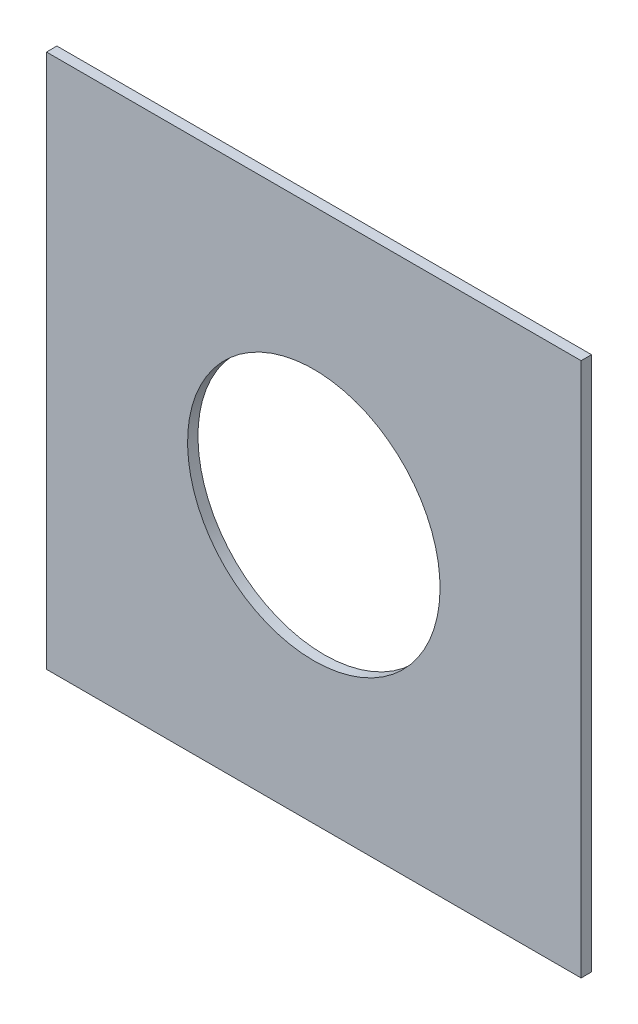
ISO-10303-21;
HEADER;
FILE_DESCRIPTION(('STEP AP214'),'2;1');
FILE_NAME('part.step','',(''),(''),'','','');
FILE_SCHEMA(('AUTOMOTIVE_DESIGN { 1 0 10303 214 1 1 1 1 }'));
ENDSEC;
DATA;
#1=APPLICATION_CONTEXT('core data for automotive mechanical design processes');
#2=APPLICATION_PROTOCOL_DEFINITION('international standard','automotive_design',2000,#1);
#3=PRODUCT_CONTEXT('',#1,'mechanical');
#4=PRODUCT('Part','Part','',(#3));
#5=PRODUCT_RELATED_PRODUCT_CATEGORY('part','',(#4));
#6=PRODUCT_DEFINITION_FORMATION('','',#4);
#7=PRODUCT_DEFINITION_CONTEXT('part definition',#1,'design');
#8=PRODUCT_DEFINITION('design','',#6,#7);
#9=PRODUCT_DEFINITION_SHAPE('','',#8);
#10=(LENGTH_UNIT() NAMED_UNIT(*) SI_UNIT(.MILLI.,.METRE.));
#11=(NAMED_UNIT(*) PLANE_ANGLE_UNIT() SI_UNIT($,.RADIAN.));
#12=(NAMED_UNIT(*) SI_UNIT($,.STERADIAN.) SOLID_ANGLE_UNIT());
#13=UNCERTAINTY_MEASURE_WITH_UNIT(LENGTH_MEASURE(1.E-05),#10,'distance_accuracy_value','');
#14=(GEOMETRIC_REPRESENTATION_CONTEXT(3) GLOBAL_UNCERTAINTY_ASSIGNED_CONTEXT((#13)) GLOBAL_UNIT_ASSIGNED_CONTEXT((#10,
#11,#12)) REPRESENTATION_CONTEXT('',''));
#15=CARTESIAN_POINT('',(0.,0.,0.));
#16=DIRECTION('',(0.,0.,1.));
#17=DIRECTION('',(1.,0.,0.));
#18=AXIS2_PLACEMENT_3D('',#15,#16,#17);
#19=CARTESIAN_POINT('',(118.105,-153.249,-0.045));
#20=DIRECTION('',(0.,0.,-1.));
#21=DIRECTION('',(0.,-1.,0.));
#22=AXIS2_PLACEMENT_3D('',#19,#20,#21);
#23=CYLINDRICAL_SURFACE('',#22,0.425);
#24=CARTESIAN_POINT('',(118.105,-153.249,-0.035));
#25=DIRECTION('',(0.,0.,-1.));
#26=DIRECTION('',(0.,-1.,0.));
#27=AXIS2_PLACEMENT_3D('',#24,#25,#26);
#28=CIRCLE('',#27,0.425);
#29=CARTESIAN_POINT('',(118.105,-153.674,-0.035));
#30=VERTEX_POINT('',#29);
#31=EDGE_CURVE('E114',#30,#30,#28,.T.);
#32=ORIENTED_EDGE('',*,*,#31,.T.);
#33=DIRECTION('',(0.,0.,1.));
#34=VECTOR('',#33,1.);
#35=CARTESIAN_POINT('',(118.105,-153.674,-0.045));
#36=LINE('',#35,#34);
#37=CARTESIAN_POINT('',(118.105,-153.674,0.));
#38=VERTEX_POINT('',#37);
#39=EDGE_CURVE('E11',#30,#38,#36,.T.);
#40=ORIENTED_EDGE('',*,*,#39,.T.);
#41=CARTESIAN_POINT('',(118.105,-153.249,0.));
#42=DIRECTION('',(0.,0.,-1.));
#43=DIRECTION('',(0.,-1.,0.));
#44=AXIS2_PLACEMENT_3D('',#41,#42,#43);
#45=CIRCLE('',#44,0.425);
#46=EDGE_CURVE('E20',#38,#38,#45,.T.);
#47=ORIENTED_EDGE('',*,*,#46,.F.);
#48=ORIENTED_EDGE('',*,*,#39,.F.);
#49=EDGE_LOOP('',(#32,#40,#47,#48));
#50=FACE_BOUND('',#49,.T.);
#51=ADVANCED_FACE('F17',(#50),#23,.F.);
#52=CARTESIAN_POINT('',(117.205,-152.349,-0.035));
#53=DIRECTION('',(0.,1.,0.));
#54=DIRECTION('',(1.,0.,0.));
#55=AXIS2_PLACEMENT_3D('',#52,#53,#54);
#56=PLANE('',#55);
#57=DIRECTION('',(0.,0.,1.));
#58=VECTOR('',#57,1.);
#59=CARTESIAN_POINT('',(117.205,-152.349,-0.035));
#60=LINE('',#59,#58);
#61=CARTESIAN_POINT('',(117.205,-152.349,-0.035));
#62=VERTEX_POINT('',#61);
#63=CARTESIAN_POINT('',(117.205,-152.349,0.));
#64=VERTEX_POINT('',#63);
#65=EDGE_CURVE('E117',#62,#64,#60,.T.);
#66=ORIENTED_EDGE('',*,*,#65,.T.);
#67=DIRECTION('',(1.,0.,0.));
#68=VECTOR('',#67,1.);
#69=CARTESIAN_POINT('',(117.205,-152.349,0.));
#70=LINE('',#69,#68);
#71=CARTESIAN_POINT('',(119.005,-152.349,0.));
#72=VERTEX_POINT('',#71);
#73=EDGE_CURVE('E111',#64,#72,#70,.T.);
#74=ORIENTED_EDGE('',*,*,#73,.T.);
#75=DIRECTION('',(0.,0.,1.));
#76=VECTOR('',#75,1.);
#77=CARTESIAN_POINT('',(119.005,-152.349,-0.035));
#78=LINE('',#77,#76);
#79=CARTESIAN_POINT('',(119.005,-152.349,-0.035));
#80=VERTEX_POINT('',#79);
#81=EDGE_CURVE('E97',#80,#72,#78,.T.);
#82=ORIENTED_EDGE('',*,*,#81,.F.);
#83=DIRECTION('',(1.,0.,0.));
#84=VECTOR('',#83,1.);
#85=CARTESIAN_POINT('',(117.205,-152.349,-0.035));
#86=LINE('',#85,#84);
#87=EDGE_CURVE('E80',#62,#80,#86,.T.);
#88=ORIENTED_EDGE('',*,*,#87,.F.);
#89=EDGE_LOOP('',(#66,#74,#82,#88));
#90=FACE_BOUND('',#89,.T.);
#91=ADVANCED_FACE('F149',(#90),#56,.T.);
#92=CARTESIAN_POINT('',(0.,0.,0.));
#93=DIRECTION('',(0.,0.,1.));
#94=DIRECTION('',(1.,0.,0.));
#95=AXIS2_PLACEMENT_3D('',#92,#93,#94);
#96=PLANE('',#95);
#97=ORIENTED_EDGE('',*,*,#46,.T.);
#98=EDGE_LOOP('',(#97));
#99=FACE_BOUND('',#98,.T.);
#100=DIRECTION('',(-1.,0.,0.));
#101=VECTOR('',#100,1.);
#102=CARTESIAN_POINT('',(119.005,-154.149,0.));
#103=LINE('',#102,#101);
#104=CARTESIAN_POINT('',(119.005,-154.149,0.));
#105=VERTEX_POINT('',#104);
#106=CARTESIAN_POINT('',(117.205,-154.149,0.));
#107=VERTEX_POINT('',#106);
#108=EDGE_CURVE('E103',#105,#107,#103,.T.);
#109=ORIENTED_EDGE('',*,*,#108,.F.);
#110=DIRECTION('',(0.,-1.,0.));
#111=VECTOR('',#110,1.);
#112=CARTESIAN_POINT('',(119.005,-152.349,0.));
#113=LINE('',#112,#111);
#114=EDGE_CURVE('E87',#72,#105,#113,.T.);
#115=ORIENTED_EDGE('',*,*,#114,.F.);
#116=ORIENTED_EDGE('',*,*,#73,.F.);
#117=DIRECTION('',(0.,1.,0.));
#118=VECTOR('',#117,1.);
#119=CARTESIAN_POINT('',(117.205,-154.149,0.));
#120=LINE('',#119,#118);
#121=EDGE_CURVE('E86',#107,#64,#120,.T.);
#122=ORIENTED_EDGE('',*,*,#121,.F.);
#123=EDGE_LOOP('',(#109,#115,#116,#122));
#124=FACE_BOUND('',#123,.T.);
#125=ADVANCED_FACE('F139',(#99,#124),#96,.T.);
#126=CARTESIAN_POINT('',(0.,0.,-0.035));
#127=DIRECTION('',(0.,0.,1.));
#128=DIRECTION('',(1.,0.,0.));
#129=AXIS2_PLACEMENT_3D('',#126,#127,#128);
#130=PLANE('',#129);
#131=ORIENTED_EDGE('',*,*,#31,.F.);
#132=EDGE_LOOP('',(#131));
#133=FACE_BOUND('',#132,.T.);
#134=DIRECTION('',(0.,1.,0.));
#135=VECTOR('',#134,1.);
#136=CARTESIAN_POINT('',(117.205,-154.149,-0.035));
#137=LINE('',#136,#135);
#138=CARTESIAN_POINT('',(117.205,-154.149,-0.035));
#139=VERTEX_POINT('',#138);
#140=EDGE_CURVE('E121',#139,#62,#137,.T.);
#141=ORIENTED_EDGE('',*,*,#140,.T.);
#142=ORIENTED_EDGE('',*,*,#87,.T.);
#143=DIRECTION('',(0.,-1.,0.));
#144=VECTOR('',#143,1.);
#145=CARTESIAN_POINT('',(119.005,-152.349,-0.035));
#146=LINE('',#145,#144);
#147=CARTESIAN_POINT('',(119.005,-154.149,-0.035));
#148=VERTEX_POINT('',#147);
#149=EDGE_CURVE('E74',#80,#148,#146,.T.);
#150=ORIENTED_EDGE('',*,*,#149,.T.);
#151=DIRECTION('',(-1.,0.,0.));
#152=VECTOR('',#151,1.);
#153=CARTESIAN_POINT('',(119.005,-154.149,-0.035));
#154=LINE('',#153,#152);
#155=EDGE_CURVE('E78',#148,#139,#154,.T.);
#156=ORIENTED_EDGE('',*,*,#155,.T.);
#157=EDGE_LOOP('',(#141,#142,#150,#156));
#158=FACE_BOUND('',#157,.T.);
#159=ADVANCED_FACE('F77',(#133,#158),#130,.F.);
#160=CARTESIAN_POINT('',(117.205,-154.149,-0.035));
#161=DIRECTION('',(-1.,0.,0.));
#162=DIRECTION('',(0.,0.,1.));
#163=AXIS2_PLACEMENT_3D('',#160,#161,#162);
#164=PLANE('',#163);
#165=DIRECTION('',(0.,0.,1.));
#166=VECTOR('',#165,1.);
#167=CARTESIAN_POINT('',(117.205,-154.149,-0.035));
#168=LINE('',#167,#166);
#169=EDGE_CURVE('E95',#139,#107,#168,.T.);
#170=ORIENTED_EDGE('',*,*,#169,.T.);
#171=ORIENTED_EDGE('',*,*,#121,.T.);
#172=ORIENTED_EDGE('',*,*,#65,.F.);
#173=ORIENTED_EDGE('',*,*,#140,.F.);
#174=EDGE_LOOP('',(#170,#171,#172,#173));
#175=FACE_BOUND('',#174,.T.);
#176=ADVANCED_FACE('F138',(#175),#164,.T.);
#177=CARTESIAN_POINT('',(119.005,-152.349,-0.035));
#178=DIRECTION('',(1.,0.,0.));
#179=DIRECTION('',(0.,1.,0.));
#180=AXIS2_PLACEMENT_3D('',#177,#178,#179);
#181=PLANE('',#180);
#182=ORIENTED_EDGE('',*,*,#81,.T.);
#183=ORIENTED_EDGE('',*,*,#114,.T.);
#184=DIRECTION('',(0.,0.,1.));
#185=VECTOR('',#184,1.);
#186=CARTESIAN_POINT('',(119.005,-154.149,-0.035));
#187=LINE('',#186,#185);
#188=EDGE_CURVE('E93',#148,#105,#187,.T.);
#189=ORIENTED_EDGE('',*,*,#188,.F.);
#190=ORIENTED_EDGE('',*,*,#149,.F.);
#191=EDGE_LOOP('',(#182,#183,#189,#190));
#192=FACE_BOUND('',#191,.T.);
#193=ADVANCED_FACE('F99',(#192),#181,.T.);
#194=CARTESIAN_POINT('',(119.005,-154.149,-0.035));
#195=DIRECTION('',(0.,-1.,0.));
#196=DIRECTION('',(0.,0.,-1.));
#197=AXIS2_PLACEMENT_3D('',#194,#195,#196);
#198=PLANE('',#197);
#199=ORIENTED_EDGE('',*,*,#188,.T.);
#200=ORIENTED_EDGE('',*,*,#108,.T.);
#201=ORIENTED_EDGE('',*,*,#169,.F.);
#202=ORIENTED_EDGE('',*,*,#155,.F.);
#203=EDGE_LOOP('',(#199,#200,#201,#202));
#204=FACE_BOUND('',#203,.T.);
#205=ADVANCED_FACE('F91',(#204),#198,.T.);
#206=CLOSED_SHELL('',(#51,#91,#125,#159,#176,#193,#205));
#207=MANIFOLD_SOLID_BREP('B1',#206);
#208=ADVANCED_BREP_SHAPE_REPRESENTATION('',(#18,#207),#14);
#209=SHAPE_DEFINITION_REPRESENTATION(#9,#208);
ENDSEC;
END-ISO-10303-21;
